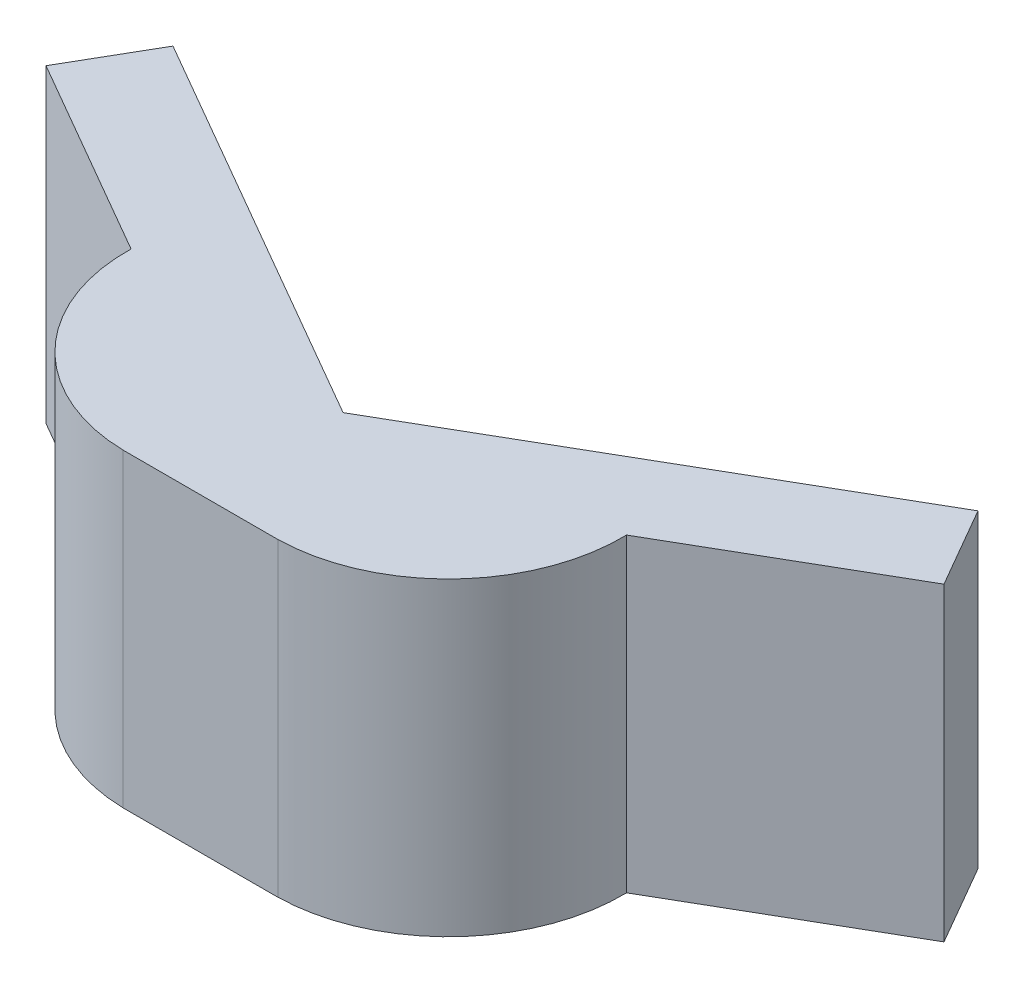
ISO-10303-21;
HEADER;
FILE_DESCRIPTION(('STEP AP214'),'2;1');
FILE_NAME('part.step','',(''),(''),'','','');
FILE_SCHEMA(('AUTOMOTIVE_DESIGN { 1 0 10303 214 1 1 1 1 }'));
ENDSEC;
DATA;
#1=APPLICATION_CONTEXT('core data for automotive mechanical design processes');
#2=APPLICATION_PROTOCOL_DEFINITION('international standard','automotive_design',2000,#1);
#3=PRODUCT_CONTEXT('',#1,'mechanical');
#4=PRODUCT('Part','Part','',(#3));
#5=PRODUCT_RELATED_PRODUCT_CATEGORY('part','',(#4));
#6=PRODUCT_DEFINITION_FORMATION('','',#4);
#7=PRODUCT_DEFINITION_CONTEXT('part definition',#1,'design');
#8=PRODUCT_DEFINITION('design','',#6,#7);
#9=PRODUCT_DEFINITION_SHAPE('','',#8);
#10=(LENGTH_UNIT() NAMED_UNIT(*) SI_UNIT(.MILLI.,.METRE.));
#11=(NAMED_UNIT(*) PLANE_ANGLE_UNIT() SI_UNIT($,.RADIAN.));
#12=(NAMED_UNIT(*) SI_UNIT($,.STERADIAN.) SOLID_ANGLE_UNIT());
#13=UNCERTAINTY_MEASURE_WITH_UNIT(LENGTH_MEASURE(1.E-05),#10,'distance_accuracy_value','');
#14=(GEOMETRIC_REPRESENTATION_CONTEXT(3) GLOBAL_UNCERTAINTY_ASSIGNED_CONTEXT((#13)) GLOBAL_UNIT_ASSIGNED_CONTEXT((#10,
#11,#12)) REPRESENTATION_CONTEXT('',''));
#15=CARTESIAN_POINT('',(0.,0.,0.));
#16=DIRECTION('',(0.,0.,1.));
#17=DIRECTION('',(1.,0.,0.));
#18=AXIS2_PLACEMENT_3D('',#15,#16,#17);
#19=CARTESIAN_POINT('',(-3.01319598552334,12.7,-1.3011391971047));
#20=DIRECTION('',(0.,-1.,0.));
#21=DIRECTION('',(0.,0.,-1.));
#22=AXIS2_PLACEMENT_3D('',#19,#20,#21);
#23=CYLINDRICAL_SURFACE('',#22,7.14252894266249);
#24=CARTESIAN_POINT('',(-3.01319598552334,0.,-1.3011391971047));
#25=DIRECTION('',(0.,1.,0.));
#26=DIRECTION('',(0.,0.,1.));
#27=AXIS2_PLACEMENT_3D('',#24,#25,#26);
#28=CIRCLE('',#27,7.14252894266249);
#29=CARTESIAN_POINT('',(-3.175,0.,5.83955678841874));
#30=VERTEX_POINT('',#29);
#31=CARTESIAN_POINT('',(-10.1538919710468,0.,-1.4629432115813));
#32=VERTEX_POINT('',#31);
#33=EDGE_CURVE('E133',#30,#32,#28,.F.);
#34=ORIENTED_EDGE('',*,*,#33,.F.);
#35=DIRECTION('',(0.,-1.,0.));
#36=VECTOR('',#35,1.);
#37=CARTESIAN_POINT('',(-3.175,12.7,5.83955678841874));
#38=LINE('',#37,#36);
#39=CARTESIAN_POINT('',(-3.175,12.7,5.83955678841874));
#40=VERTEX_POINT('',#39);
#41=EDGE_CURVE('E11',#40,#30,#38,.T.);
#42=ORIENTED_EDGE('',*,*,#41,.F.);
#43=CARTESIAN_POINT('',(-3.01319598552334,12.7,-1.3011391971047));
#44=DIRECTION('',(0.,1.,0.));
#45=DIRECTION('',(0.,0.,1.));
#46=AXIS2_PLACEMENT_3D('',#43,#44,#45);
#47=CIRCLE('',#46,7.14252894266249);
#48=CARTESIAN_POINT('',(-10.1538919710468,12.7,-1.4629432115813));
#49=VERTEX_POINT('',#48);
#50=EDGE_CURVE('E155',#40,#49,#47,.F.);
#51=ORIENTED_EDGE('',*,*,#50,.T.);
#52=DIRECTION('',(0.,-1.,0.));
#53=VECTOR('',#52,1.);
#54=CARTESIAN_POINT('',(-10.1538919710468,12.7,-1.4629432115813));
#55=LINE('',#54,#53);
#56=EDGE_CURVE('E51',#49,#32,#55,.T.);
#57=ORIENTED_EDGE('',*,*,#56,.T.);
#58=EDGE_LOOP('',(#34,#42,#51,#57));
#59=FACE_BOUND('',#58,.T.);
#60=ADVANCED_FACE('F35',(#59),#23,.T.);
#61=CARTESIAN_POINT('',(0.,12.7,5.83955678841872));
#62=DIRECTION('',(0.,0.,1.));
#63=DIRECTION('',(1.,0.,0.));
#64=AXIS2_PLACEMENT_3D('',#61,#62,#63);
#65=PLANE('',#64);
#66=DIRECTION('',(-1.,0.,0.));
#67=VECTOR('',#66,1.);
#68=CARTESIAN_POINT('',(0.,0.,5.83955678841872));
#69=LINE('',#68,#67);
#70=CARTESIAN_POINT('',(3.175,0.,5.83955678841869));
#71=VERTEX_POINT('',#70);
#72=EDGE_CURVE('E135',#71,#30,#69,.T.);
#73=ORIENTED_EDGE('',*,*,#72,.F.);
#74=DIRECTION('',(0.,-1.,0.));
#75=VECTOR('',#74,1.);
#76=CARTESIAN_POINT('',(3.175,12.7,5.83955678841869));
#77=LINE('',#76,#75);
#78=CARTESIAN_POINT('',(3.175,12.7,5.83955678841869));
#79=VERTEX_POINT('',#78);
#80=EDGE_CURVE('E43',#79,#71,#77,.T.);
#81=ORIENTED_EDGE('',*,*,#80,.F.);
#82=DIRECTION('',(-1.,0.,0.));
#83=VECTOR('',#82,1.);
#84=CARTESIAN_POINT('',(0.,12.7,5.83955678841872));
#85=LINE('',#84,#83);
#86=EDGE_CURVE('E194',#79,#40,#85,.T.);
#87=ORIENTED_EDGE('',*,*,#86,.T.);
#88=ORIENTED_EDGE('',*,*,#41,.T.);
#89=EDGE_LOOP('',(#73,#81,#87,#88));
#90=FACE_BOUND('',#89,.T.);
#91=ADVANCED_FACE('F175',(#90),#65,.T.);
#92=CARTESIAN_POINT('',(3.01319598552339,12.7,-1.30113919710469));
#93=DIRECTION('',(0.,-1.,0.));
#94=DIRECTION('',(0.,0.,-1.));
#95=AXIS2_PLACEMENT_3D('',#92,#93,#94);
#96=CYLINDRICAL_SURFACE('',#95,7.14252894266244);
#97=CARTESIAN_POINT('',(3.01319598552339,0.,-1.30113919710469));
#98=DIRECTION('',(0.,1.,0.));
#99=DIRECTION('',(0.,0.,1.));
#100=AXIS2_PLACEMENT_3D('',#97,#98,#99);
#101=CIRCLE('',#100,7.14252894266244);
#102=CARTESIAN_POINT('',(10.1538919710468,0.,-1.4629432115813));
#103=VERTEX_POINT('',#102);
#104=EDGE_CURVE('E138',#103,#71,#101,.F.);
#105=ORIENTED_EDGE('',*,*,#104,.F.);
#106=DIRECTION('',(0.,-1.,0.));
#107=VECTOR('',#106,1.);
#108=CARTESIAN_POINT('',(10.1538919710468,12.7,-1.4629432115813));
#109=LINE('',#108,#107);
#110=CARTESIAN_POINT('',(10.1538919710468,12.7,-1.4629432115813));
#111=VERTEX_POINT('',#110);
#112=EDGE_CURVE('E164',#111,#103,#109,.T.);
#113=ORIENTED_EDGE('',*,*,#112,.F.);
#114=CARTESIAN_POINT('',(3.01319598552339,12.7,-1.30113919710469));
#115=DIRECTION('',(0.,1.,0.));
#116=DIRECTION('',(0.,0.,1.));
#117=AXIS2_PLACEMENT_3D('',#114,#115,#116);
#118=CIRCLE('',#117,7.14252894266244);
#119=EDGE_CURVE('E171',#111,#79,#118,.F.);
#120=ORIENTED_EDGE('',*,*,#119,.T.);
#121=ORIENTED_EDGE('',*,*,#80,.T.);
#122=EDGE_LOOP('',(#105,#113,#120,#121));
#123=FACE_BOUND('',#122,.T.);
#124=ADVANCED_FACE('F169',(#123),#96,.T.);
#125=CARTESIAN_POINT('',(1.90500000000001,12.7,3.29955678841871));
#126=DIRECTION('',(-0.500000000000001,0.,-0.866025403784438));
#127=DIRECTION('',(-0.866025403784438,0.,0.500000000000001));
#128=AXIS2_PLACEMENT_3D('',#125,#126,#127);
#129=PLANE('',#128);
#130=DIRECTION('',(0.866025403784438,0.,-0.500000000000001));
#131=VECTOR('',#130,1.);
#132=CARTESIAN_POINT('',(1.90500000000001,0.,3.29955678841871));
#133=LINE('',#132,#131);
#134=CARTESIAN_POINT('',(18.4027839420935,0.,-6.22544321158131));
#135=VERTEX_POINT('',#134);
#136=EDGE_CURVE('E141',#103,#135,#133,.T.);
#137=ORIENTED_EDGE('',*,*,#136,.T.);
#138=DIRECTION('',(0.,-1.,0.));
#139=VECTOR('',#138,1.);
#140=CARTESIAN_POINT('',(18.4027839420935,12.7,-6.22544321158131));
#141=LINE('',#140,#139);
#142=CARTESIAN_POINT('',(18.4027839420935,12.7,-6.22544321158131));
#143=VERTEX_POINT('',#142);
#144=EDGE_CURVE('E161',#143,#135,#141,.T.);
#145=ORIENTED_EDGE('',*,*,#144,.F.);
#146=DIRECTION('',(0.866025403784438,0.,-0.500000000000001));
#147=VECTOR('',#146,1.);
#148=CARTESIAN_POINT('',(1.90500000000001,12.7,3.29955678841871));
#149=LINE('',#148,#147);
#150=EDGE_CURVE('E189',#111,#143,#149,.T.);
#151=ORIENTED_EDGE('',*,*,#150,.F.);
#152=ORIENTED_EDGE('',*,*,#112,.T.);
#153=EDGE_LOOP('',(#137,#145,#151,#152));
#154=FACE_BOUND('',#153,.T.);
#155=ADVANCED_FACE('F182',(#154),#129,.F.);
#156=CARTESIAN_POINT('',(16.4977839420936,12.7,-9.52500000000001));
#157=DIRECTION('',(-0.866025403784438,0.,0.500000000000001));
#158=DIRECTION('',(0.500000000000001,0.,0.866025403784438));
#159=AXIS2_PLACEMENT_3D('',#156,#157,#158);
#160=PLANE('',#159);
#161=DIRECTION('',(-0.500000000000001,0.,-0.866025403784438));
#162=VECTOR('',#161,1.);
#163=CARTESIAN_POINT('',(16.4977839420936,0.,-9.52500000000001));
#164=LINE('',#163,#162);
#165=CARTESIAN_POINT('',(16.4977839420935,0.,-9.52500000000003));
#166=VERTEX_POINT('',#165);
#167=EDGE_CURVE('E143',#135,#166,#164,.T.);
#168=ORIENTED_EDGE('',*,*,#167,.T.);
#169=DIRECTION('',(0.,-1.,0.));
#170=VECTOR('',#169,1.);
#171=CARTESIAN_POINT('',(16.4977839420935,12.7,-9.52500000000003));
#172=LINE('',#171,#170);
#173=CARTESIAN_POINT('',(16.4977839420935,12.7,-9.52500000000003));
#174=VERTEX_POINT('',#173);
#175=EDGE_CURVE('E159',#174,#166,#172,.T.);
#176=ORIENTED_EDGE('',*,*,#175,.F.);
#177=DIRECTION('',(-0.500000000000001,0.,-0.866025403784438));
#178=VECTOR('',#177,1.);
#179=CARTESIAN_POINT('',(16.4977839420936,12.7,-9.52500000000001));
#180=LINE('',#179,#178);
#181=EDGE_CURVE('E188',#143,#174,#180,.T.);
#182=ORIENTED_EDGE('',*,*,#181,.F.);
#183=ORIENTED_EDGE('',*,*,#144,.T.);
#184=EDGE_LOOP('',(#168,#176,#182,#183));
#185=FACE_BOUND('',#184,.T.);
#186=ADVANCED_FACE('F186',(#185),#160,.F.);
#187=CARTESIAN_POINT('',(0.,12.7,0.));
#188=DIRECTION('',(-0.500000000000001,0.,-0.866025403784438));
#189=DIRECTION('',(-0.866025403784438,0.,0.500000000000001));
#190=AXIS2_PLACEMENT_3D('',#187,#188,#189);
#191=PLANE('',#190);
#192=DIRECTION('',(0.866025403784438,0.,-0.500000000000001));
#193=VECTOR('',#192,1.);
#194=CARTESIAN_POINT('',(0.,0.,0.));
#195=LINE('',#194,#193);
#196=CARTESIAN_POINT('',(0.,0.,0.));
#197=VERTEX_POINT('',#196);
#198=EDGE_CURVE('E146',#197,#166,#195,.T.);
#199=ORIENTED_EDGE('',*,*,#198,.F.);
#200=DIRECTION('',(0.,-1.,0.));
#201=VECTOR('',#200,1.);
#202=CARTESIAN_POINT('',(0.,12.7,0.));
#203=LINE('',#202,#201);
#204=CARTESIAN_POINT('',(0.,12.7,0.));
#205=VERTEX_POINT('',#204);
#206=EDGE_CURVE('E125',#205,#197,#203,.T.);
#207=ORIENTED_EDGE('',*,*,#206,.F.);
#208=DIRECTION('',(0.866025403784438,0.,-0.500000000000001));
#209=VECTOR('',#208,1.);
#210=CARTESIAN_POINT('',(0.,12.7,0.));
#211=LINE('',#210,#209);
#212=EDGE_CURVE('E115',#205,#174,#211,.T.);
#213=ORIENTED_EDGE('',*,*,#212,.T.);
#214=ORIENTED_EDGE('',*,*,#175,.T.);
#215=EDGE_LOOP('',(#199,#207,#213,#214));
#216=FACE_BOUND('',#215,.T.);
#217=ADVANCED_FACE('F219',(#216),#191,.T.);
#218=CARTESIAN_POINT('',(0.,12.7,0.));
#219=DIRECTION('',(-0.5,0.,0.866025403784439));
#220=DIRECTION('',(0.866025403784439,0.,0.5));
#221=AXIS2_PLACEMENT_3D('',#218,#219,#220);
#222=PLANE('',#221);
#223=DIRECTION('',(-0.866025403784439,0.,-0.5));
#224=VECTOR('',#223,1.);
#225=CARTESIAN_POINT('',(0.,0.,0.));
#226=LINE('',#225,#224);
#227=CARTESIAN_POINT('',(-16.4977839420936,0.,-9.52500000000003));
#228=VERTEX_POINT('',#227);
#229=EDGE_CURVE('E122',#197,#228,#226,.T.);
#230=ORIENTED_EDGE('',*,*,#229,.T.);
#231=DIRECTION('',(0.,-1.,0.));
#232=VECTOR('',#231,1.);
#233=CARTESIAN_POINT('',(-16.4977839420936,12.7,-9.52500000000003));
#234=LINE('',#233,#232);
#235=CARTESIAN_POINT('',(-16.4977839420936,12.7,-9.52500000000003));
#236=VERTEX_POINT('',#235);
#237=EDGE_CURVE('E119',#236,#228,#234,.T.);
#238=ORIENTED_EDGE('',*,*,#237,.F.);
#239=DIRECTION('',(-0.866025403784439,0.,-0.5));
#240=VECTOR('',#239,1.);
#241=CARTESIAN_POINT('',(0.,12.7,0.));
#242=LINE('',#241,#240);
#243=EDGE_CURVE('E108',#205,#236,#242,.T.);
#244=ORIENTED_EDGE('',*,*,#243,.F.);
#245=ORIENTED_EDGE('',*,*,#206,.T.);
#246=EDGE_LOOP('',(#230,#238,#244,#245));
#247=FACE_BOUND('',#246,.T.);
#248=ADVANCED_FACE('F120',(#247),#222,.F.);
#249=CARTESIAN_POINT('',(-16.4977839420936,12.7,-9.52499999999996));
#250=DIRECTION('',(-0.866025403784441,0.,-0.499999999999997));
#251=DIRECTION('',(-0.499999999999997,0.,0.866025403784441));
#252=AXIS2_PLACEMENT_3D('',#249,#250,#251);
#253=PLANE('',#252);
#254=DIRECTION('',(0.499999999999997,0.,-0.866025403784441));
#255=VECTOR('',#254,1.);
#256=CARTESIAN_POINT('',(-16.4977839420936,0.,-9.52499999999996));
#257=LINE('',#256,#255);
#258=CARTESIAN_POINT('',(-18.4027839420936,0.,-6.22544321158131));
#259=VERTEX_POINT('',#258);
#260=EDGE_CURVE('E150',#259,#228,#257,.T.);
#261=ORIENTED_EDGE('',*,*,#260,.F.);
#262=DIRECTION('',(0.,-1.,0.));
#263=VECTOR('',#262,1.);
#264=CARTESIAN_POINT('',(-18.4027839420936,12.7,-6.22544321158131));
#265=LINE('',#264,#263);
#266=CARTESIAN_POINT('',(-18.4027839420936,12.7,-6.22544321158131));
#267=VERTEX_POINT('',#266);
#268=EDGE_CURVE('E79',#267,#259,#265,.T.);
#269=ORIENTED_EDGE('',*,*,#268,.F.);
#270=DIRECTION('',(0.499999999999997,0.,-0.866025403784441));
#271=VECTOR('',#270,1.);
#272=CARTESIAN_POINT('',(-16.4977839420936,12.7,-9.52499999999996));
#273=LINE('',#272,#271);
#274=EDGE_CURVE('E113',#267,#236,#273,.T.);
#275=ORIENTED_EDGE('',*,*,#274,.T.);
#276=ORIENTED_EDGE('',*,*,#237,.T.);
#277=EDGE_LOOP('',(#261,#269,#275,#276));
#278=FACE_BOUND('',#277,.T.);
#279=ADVANCED_FACE('F127',(#278),#253,.T.);
#280=CARTESIAN_POINT('',(-1.90499999999999,12.7,3.2995567884187));
#281=DIRECTION('',(-0.5,0.,0.866025403784439));
#282=DIRECTION('',(0.866025403784439,0.,0.5));
#283=AXIS2_PLACEMENT_3D('',#280,#281,#282);
#284=PLANE('',#283);
#285=DIRECTION('',(-0.866025403784439,0.,-0.5));
#286=VECTOR('',#285,1.);
#287=CARTESIAN_POINT('',(-1.90499999999999,0.,3.2995567884187));
#288=LINE('',#287,#286);
#289=EDGE_CURVE('E152',#32,#259,#288,.T.);
#290=ORIENTED_EDGE('',*,*,#289,.F.);
#291=ORIENTED_EDGE('',*,*,#56,.F.);
#292=DIRECTION('',(-0.866025403784439,0.,-0.5));
#293=VECTOR('',#292,1.);
#294=CARTESIAN_POINT('',(-1.90499999999999,12.7,3.2995567884187));
#295=LINE('',#294,#293);
#296=EDGE_CURVE('E128',#49,#267,#295,.T.);
#297=ORIENTED_EDGE('',*,*,#296,.T.);
#298=ORIENTED_EDGE('',*,*,#268,.T.);
#299=EDGE_LOOP('',(#290,#291,#297,#298));
#300=FACE_BOUND('',#299,.T.);
#301=ADVANCED_FACE('F196',(#300),#284,.T.);
#302=CARTESIAN_POINT('',(0.,12.7,0.));
#303=DIRECTION('',(0.,1.,0.));
#304=DIRECTION('',(0.,0.,1.));
#305=AXIS2_PLACEMENT_3D('',#302,#303,#304);
#306=PLANE('',#305);
#307=ORIENTED_EDGE('',*,*,#50,.F.);
#308=ORIENTED_EDGE('',*,*,#86,.F.);
#309=ORIENTED_EDGE('',*,*,#119,.F.);
#310=ORIENTED_EDGE('',*,*,#150,.T.);
#311=ORIENTED_EDGE('',*,*,#181,.T.);
#312=ORIENTED_EDGE('',*,*,#212,.F.);
#313=ORIENTED_EDGE('',*,*,#243,.T.);
#314=ORIENTED_EDGE('',*,*,#274,.F.);
#315=ORIENTED_EDGE('',*,*,#296,.F.);
#316=EDGE_LOOP('',(#307,#308,#309,#310,#311,#312,#313,#314,#315));
#317=FACE_BOUND('',#316,.T.);
#318=ADVANCED_FACE('F110',(#317),#306,.T.);
#319=CARTESIAN_POINT('',(0.,0.,0.));
#320=DIRECTION('',(0.,1.,0.));
#321=DIRECTION('',(0.,0.,1.));
#322=AXIS2_PLACEMENT_3D('',#319,#320,#321);
#323=PLANE('',#322);
#324=ORIENTED_EDGE('',*,*,#33,.T.);
#325=ORIENTED_EDGE('',*,*,#289,.T.);
#326=ORIENTED_EDGE('',*,*,#260,.T.);
#327=ORIENTED_EDGE('',*,*,#229,.F.);
#328=ORIENTED_EDGE('',*,*,#198,.T.);
#329=ORIENTED_EDGE('',*,*,#167,.F.);
#330=ORIENTED_EDGE('',*,*,#136,.F.);
#331=ORIENTED_EDGE('',*,*,#104,.T.);
#332=ORIENTED_EDGE('',*,*,#72,.T.);
#333=EDGE_LOOP('',(#324,#325,#326,#327,#328,#329,#330,#331,#332));
#334=FACE_BOUND('',#333,.T.);
#335=ADVANCED_FACE('F178',(#334),#323,.F.);
#336=CLOSED_SHELL('',(#60,#91,#124,#155,#186,#217,#248,#279,#301,#318,#335));
#337=MANIFOLD_SOLID_BREP('B2',#336);
#338=ADVANCED_BREP_SHAPE_REPRESENTATION('',(#18,#337),#14);
#339=SHAPE_DEFINITION_REPRESENTATION(#9,#338);
ENDSEC;
END-ISO-10303-21;
